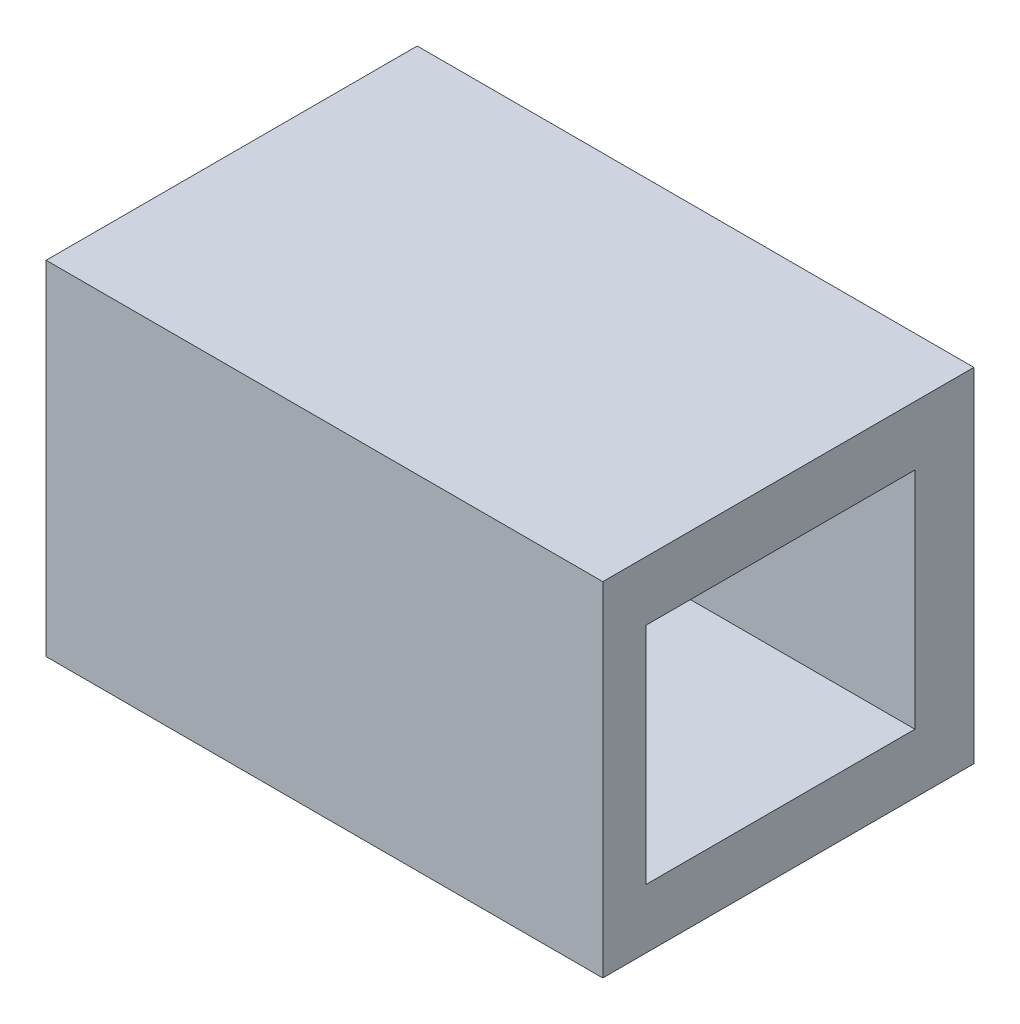
ISO-10303-21;
HEADER;
FILE_DESCRIPTION(('STEP AP214'),'2;1');
FILE_NAME('part.step','',(''),(''),'','','');
FILE_SCHEMA(('AUTOMOTIVE_DESIGN { 1 0 10303 214 1 1 1 1 }'));
ENDSEC;
DATA;
#1=APPLICATION_CONTEXT('core data for automotive mechanical design processes');
#2=APPLICATION_PROTOCOL_DEFINITION('international standard','automotive_design',2000,#1);
#3=PRODUCT_CONTEXT('',#1,'mechanical');
#4=PRODUCT('Part','Part','',(#3));
#5=PRODUCT_RELATED_PRODUCT_CATEGORY('part','',(#4));
#6=PRODUCT_DEFINITION_FORMATION('','',#4);
#7=PRODUCT_DEFINITION_CONTEXT('part definition',#1,'design');
#8=PRODUCT_DEFINITION('design','',#6,#7);
#9=PRODUCT_DEFINITION_SHAPE('','',#8);
#10=(LENGTH_UNIT() NAMED_UNIT(*) SI_UNIT(.MILLI.,.METRE.));
#11=(NAMED_UNIT(*) PLANE_ANGLE_UNIT() SI_UNIT($,.RADIAN.));
#12=(NAMED_UNIT(*) SI_UNIT($,.STERADIAN.) SOLID_ANGLE_UNIT());
#13=UNCERTAINTY_MEASURE_WITH_UNIT(LENGTH_MEASURE(1.E-05),#10,'distance_accuracy_value','');
#14=(GEOMETRIC_REPRESENTATION_CONTEXT(3) GLOBAL_UNCERTAINTY_ASSIGNED_CONTEXT((#13)) GLOBAL_UNIT_ASSIGNED_CONTEXT((#10,
#11,#12)) REPRESENTATION_CONTEXT('',''));
#15=CARTESIAN_POINT('',(0.,0.,0.));
#16=DIRECTION('',(0.,0.,1.));
#17=DIRECTION('',(1.,0.,0.));
#18=AXIS2_PLACEMENT_3D('',#15,#16,#17);
#19=CARTESIAN_POINT('',(0.,0.,20.));
#20=DIRECTION('',(1.,0.,0.));
#21=DIRECTION('',(0.,0.,-1.));
#22=AXIS2_PLACEMENT_3D('',#19,#20,#21);
#23=PLANE('',#22);
#24=DIRECTION('',(0.,-1.,0.));
#25=VECTOR('',#24,1.);
#26=CARTESIAN_POINT('',(0.,0.,17.6770086484339));
#27=LINE('',#26,#25);
#28=CARTESIAN_POINT('',(0.,15.3,17.6770086484339));
#29=VERTEX_POINT('',#28);
#30=CARTESIAN_POINT('',(0.,3.19999999999999,17.6770086484339));
#31=VERTEX_POINT('',#30);
#32=EDGE_CURVE('E128',#29,#31,#27,.T.);
#33=ORIENTED_EDGE('',*,*,#32,.T.);
#34=DIRECTION('',(0.,0.,-1.));
#35=VECTOR('',#34,1.);
#36=CARTESIAN_POINT('',(0.,3.19999999999999,20.));
#37=LINE('',#36,#35);
#38=CARTESIAN_POINT('',(0.,3.19999999999999,3.17700864843391));
#39=VERTEX_POINT('',#38);
#40=EDGE_CURVE('E131',#31,#39,#37,.T.);
#41=ORIENTED_EDGE('',*,*,#40,.T.);
#42=DIRECTION('',(0.,1.,0.));
#43=VECTOR('',#42,1.);
#44=CARTESIAN_POINT('',(0.,0.,3.17700864843391));
#45=LINE('',#44,#43);
#46=CARTESIAN_POINT('',(0.,15.3,3.17700864843391));
#47=VERTEX_POINT('',#46);
#48=EDGE_CURVE('E123',#39,#47,#45,.T.);
#49=ORIENTED_EDGE('',*,*,#48,.T.);
#50=DIRECTION('',(0.,0.,1.));
#51=VECTOR('',#50,1.);
#52=CARTESIAN_POINT('',(0.,15.3,20.));
#53=LINE('',#52,#51);
#54=EDGE_CURVE('E103',#47,#29,#53,.T.);
#55=ORIENTED_EDGE('',*,*,#54,.T.);
#56=EDGE_LOOP('',(#33,#41,#49,#55));
#57=FACE_BOUND('',#56,.T.);
#58=DIRECTION('',(0.,-1.,0.));
#59=VECTOR('',#58,1.);
#60=CARTESIAN_POINT('',(0.,0.,0.));
#61=LINE('',#60,#59);
#62=CARTESIAN_POINT('',(0.,18.5,0.));
#63=VERTEX_POINT('',#62);
#64=CARTESIAN_POINT('',(0.,0.,0.));
#65=VERTEX_POINT('',#64);
#66=EDGE_CURVE('E134',#63,#65,#61,.T.);
#67=ORIENTED_EDGE('',*,*,#66,.T.);
#68=DIRECTION('',(0.,0.,-1.));
#69=VECTOR('',#68,1.);
#70=CARTESIAN_POINT('',(0.,0.,20.));
#71=LINE('',#70,#69);
#72=CARTESIAN_POINT('',(0.,0.,20.));
#73=VERTEX_POINT('',#72);
#74=EDGE_CURVE('E11',#73,#65,#71,.T.);
#75=ORIENTED_EDGE('',*,*,#74,.F.);
#76=DIRECTION('',(0.,-1.,0.));
#77=VECTOR('',#76,1.);
#78=CARTESIAN_POINT('',(0.,0.,20.));
#79=LINE('',#78,#77);
#80=CARTESIAN_POINT('',(0.,18.5,20.));
#81=VERTEX_POINT('',#80);
#82=EDGE_CURVE('E135',#81,#73,#79,.T.);
#83=ORIENTED_EDGE('',*,*,#82,.F.);
#84=DIRECTION('',(0.,0.,-1.));
#85=VECTOR('',#84,1.);
#86=CARTESIAN_POINT('',(0.,18.5,20.));
#87=LINE('',#86,#85);
#88=EDGE_CURVE('E145',#81,#63,#87,.T.);
#89=ORIENTED_EDGE('',*,*,#88,.T.);
#90=EDGE_LOOP('',(#67,#75,#83,#89));
#91=FACE_BOUND('',#90,.T.);
#92=ADVANCED_FACE('F33',(#57,#91),#23,.F.);
#93=CARTESIAN_POINT('',(0.,0.,20.));
#94=DIRECTION('',(0.,1.,0.));
#95=DIRECTION('',(0.,0.,1.));
#96=AXIS2_PLACEMENT_3D('',#93,#94,#95);
#97=PLANE('',#96);
#98=DIRECTION('',(1.,0.,0.));
#99=VECTOR('',#98,1.);
#100=CARTESIAN_POINT('',(0.,0.,0.));
#101=LINE('',#100,#99);
#102=CARTESIAN_POINT('',(30.,0.,0.));
#103=VERTEX_POINT('',#102);
#104=EDGE_CURVE('E148',#65,#103,#101,.T.);
#105=ORIENTED_EDGE('',*,*,#104,.T.);
#106=DIRECTION('',(0.,0.,-1.));
#107=VECTOR('',#106,1.);
#108=CARTESIAN_POINT('',(30.,0.,20.));
#109=LINE('',#108,#107);
#110=CARTESIAN_POINT('',(30.,0.,20.));
#111=VERTEX_POINT('',#110);
#112=EDGE_CURVE('E40',#111,#103,#109,.T.);
#113=ORIENTED_EDGE('',*,*,#112,.F.);
#114=DIRECTION('',(1.,0.,0.));
#115=VECTOR('',#114,1.);
#116=CARTESIAN_POINT('',(0.,0.,20.));
#117=LINE('',#116,#115);
#118=EDGE_CURVE('E138',#73,#111,#117,.T.);
#119=ORIENTED_EDGE('',*,*,#118,.F.);
#120=ORIENTED_EDGE('',*,*,#74,.T.);
#121=EDGE_LOOP('',(#105,#113,#119,#120));
#122=FACE_BOUND('',#121,.T.);
#123=ADVANCED_FACE('F176',(#122),#97,.F.);
#124=CARTESIAN_POINT('',(30.,0.,20.));
#125=DIRECTION('',(-1.,0.,0.));
#126=DIRECTION('',(0.,-1.,0.));
#127=AXIS2_PLACEMENT_3D('',#124,#125,#126);
#128=PLANE('',#127);
#129=DIRECTION('',(0.,1.,0.));
#130=VECTOR('',#129,1.);
#131=CARTESIAN_POINT('',(30.,15.3,3.17700864843391));
#132=LINE('',#131,#130);
#133=CARTESIAN_POINT('',(30.,3.19999999999999,3.17700864843391));
#134=VERTEX_POINT('',#133);
#135=CARTESIAN_POINT('',(30.,15.3,3.17700864843391));
#136=VERTEX_POINT('',#135);
#137=EDGE_CURVE('E109',#134,#136,#132,.T.);
#138=ORIENTED_EDGE('',*,*,#137,.F.);
#139=DIRECTION('',(0.,0.,-1.));
#140=VECTOR('',#139,1.);
#141=CARTESIAN_POINT('',(30.,3.2,3.17700864843391));
#142=LINE('',#141,#140);
#143=CARTESIAN_POINT('',(30.,3.2,17.6770086484339));
#144=VERTEX_POINT('',#143);
#145=EDGE_CURVE('E55',#144,#134,#142,.T.);
#146=ORIENTED_EDGE('',*,*,#145,.F.);
#147=DIRECTION('',(0.,-1.,0.));
#148=VECTOR('',#147,1.);
#149=CARTESIAN_POINT('',(30.,3.2,17.6770086484339));
#150=LINE('',#149,#148);
#151=CARTESIAN_POINT('',(30.,15.3,17.6770086484339));
#152=VERTEX_POINT('',#151);
#153=EDGE_CURVE('E116',#152,#144,#150,.T.);
#154=ORIENTED_EDGE('',*,*,#153,.F.);
#155=DIRECTION('',(0.,0.,1.));
#156=VECTOR('',#155,1.);
#157=CARTESIAN_POINT('',(30.,15.3,17.6770086484339));
#158=LINE('',#157,#156);
#159=EDGE_CURVE('E100',#136,#152,#158,.T.);
#160=ORIENTED_EDGE('',*,*,#159,.F.);
#161=EDGE_LOOP('',(#138,#146,#154,#160));
#162=FACE_BOUND('',#161,.T.);
#163=DIRECTION('',(0.,1.,0.));
#164=VECTOR('',#163,1.);
#165=CARTESIAN_POINT('',(30.,0.,0.));
#166=LINE('',#165,#164);
#167=CARTESIAN_POINT('',(30.,18.5,0.));
#168=VERTEX_POINT('',#167);
#169=EDGE_CURVE('E150',#103,#168,#166,.T.);
#170=ORIENTED_EDGE('',*,*,#169,.T.);
#171=DIRECTION('',(0.,0.,-1.));
#172=VECTOR('',#171,1.);
#173=CARTESIAN_POINT('',(30.,18.5,20.));
#174=LINE('',#173,#172);
#175=CARTESIAN_POINT('',(30.,18.5,20.));
#176=VERTEX_POINT('',#175);
#177=EDGE_CURVE('E155',#176,#168,#174,.T.);
#178=ORIENTED_EDGE('',*,*,#177,.F.);
#179=DIRECTION('',(0.,1.,0.));
#180=VECTOR('',#179,1.);
#181=CARTESIAN_POINT('',(30.,0.,20.));
#182=LINE('',#181,#180);
#183=EDGE_CURVE('E141',#111,#176,#182,.T.);
#184=ORIENTED_EDGE('',*,*,#183,.F.);
#185=ORIENTED_EDGE('',*,*,#112,.T.);
#186=EDGE_LOOP('',(#170,#178,#184,#185));
#187=FACE_BOUND('',#186,.T.);
#188=ADVANCED_FACE('F113',(#162,#187),#128,.F.);
#189=CARTESIAN_POINT('',(0.,18.5,20.));
#190=DIRECTION('',(0.,-1.,0.));
#191=DIRECTION('',(0.,0.,-1.));
#192=AXIS2_PLACEMENT_3D('',#189,#190,#191);
#193=PLANE('',#192);
#194=DIRECTION('',(-1.,0.,0.));
#195=VECTOR('',#194,1.);
#196=CARTESIAN_POINT('',(0.,18.5,0.));
#197=LINE('',#196,#195);
#198=EDGE_CURVE('E139',#168,#63,#197,.T.);
#199=ORIENTED_EDGE('',*,*,#198,.T.);
#200=ORIENTED_EDGE('',*,*,#88,.F.);
#201=DIRECTION('',(-1.,0.,0.));
#202=VECTOR('',#201,1.);
#203=CARTESIAN_POINT('',(0.,18.5,20.));
#204=LINE('',#203,#202);
#205=EDGE_CURVE('E143',#176,#81,#204,.T.);
#206=ORIENTED_EDGE('',*,*,#205,.F.);
#207=ORIENTED_EDGE('',*,*,#177,.T.);
#208=EDGE_LOOP('',(#199,#200,#206,#207));
#209=FACE_BOUND('',#208,.T.);
#210=ADVANCED_FACE('F169',(#209),#193,.F.);
#211=CARTESIAN_POINT('',(0.,0.,20.));
#212=DIRECTION('',(0.,0.,-1.));
#213=DIRECTION('',(-1.,0.,0.));
#214=AXIS2_PLACEMENT_3D('',#211,#212,#213);
#215=PLANE('',#214);
#216=ORIENTED_EDGE('',*,*,#82,.T.);
#217=ORIENTED_EDGE('',*,*,#118,.T.);
#218=ORIENTED_EDGE('',*,*,#183,.T.);
#219=ORIENTED_EDGE('',*,*,#205,.T.);
#220=EDGE_LOOP('',(#216,#217,#218,#219));
#221=FACE_BOUND('',#220,.T.);
#222=ADVANCED_FACE('F175',(#221),#215,.F.);
#223=CARTESIAN_POINT('',(0.,0.,0.));
#224=DIRECTION('',(0.,0.,-1.));
#225=DIRECTION('',(-1.,0.,0.));
#226=AXIS2_PLACEMENT_3D('',#223,#224,#225);
#227=PLANE('',#226);
#228=ORIENTED_EDGE('',*,*,#66,.F.);
#229=ORIENTED_EDGE('',*,*,#198,.F.);
#230=ORIENTED_EDGE('',*,*,#169,.F.);
#231=ORIENTED_EDGE('',*,*,#104,.F.);
#232=EDGE_LOOP('',(#228,#229,#230,#231));
#233=FACE_BOUND('',#232,.T.);
#234=ADVANCED_FACE('F166',(#233),#227,.T.);
#235=CARTESIAN_POINT('',(-9.00000000000001,3.19999999999999,3.17700864843391));
#236=DIRECTION('',(0.,-1.,0.));
#237=DIRECTION('',(1.,0.,0.));
#238=AXIS2_PLACEMENT_3D('',#235,#236,#237);
#239=PLANE('',#238);
#240=DIRECTION('',(1.,0.,0.));
#241=VECTOR('',#240,1.);
#242=CARTESIAN_POINT('',(-9.00000000000001,3.19999999999999,17.6770086484339));
#243=LINE('',#242,#241);
#244=EDGE_CURVE('E121',#31,#144,#243,.T.);
#245=ORIENTED_EDGE('',*,*,#244,.T.);
#246=ORIENTED_EDGE('',*,*,#145,.T.);
#247=DIRECTION('',(1.,0.,0.));
#248=VECTOR('',#247,1.);
#249=CARTESIAN_POINT('',(-9.00000000000001,3.19999999999999,3.17700864843391));
#250=LINE('',#249,#248);
#251=EDGE_CURVE('E106',#39,#134,#250,.T.);
#252=ORIENTED_EDGE('',*,*,#251,.F.);
#253=ORIENTED_EDGE('',*,*,#40,.F.);
#254=EDGE_LOOP('',(#245,#246,#252,#253));
#255=FACE_BOUND('',#254,.T.);
#256=ADVANCED_FACE('F189',(#255),#239,.F.);
#257=CARTESIAN_POINT('',(-9.00000000000001,3.19999999999999,17.6770086484339));
#258=DIRECTION('',(0.,0.,1.));
#259=DIRECTION('',(1.,0.,0.));
#260=AXIS2_PLACEMENT_3D('',#257,#258,#259);
#261=PLANE('',#260);
#262=DIRECTION('',(1.,0.,0.));
#263=VECTOR('',#262,1.);
#264=CARTESIAN_POINT('',(-9.00000000000002,15.3,17.6770086484339));
#265=LINE('',#264,#263);
#266=EDGE_CURVE('E105',#29,#152,#265,.T.);
#267=ORIENTED_EDGE('',*,*,#266,.T.);
#268=ORIENTED_EDGE('',*,*,#153,.T.);
#269=ORIENTED_EDGE('',*,*,#244,.F.);
#270=ORIENTED_EDGE('',*,*,#32,.F.);
#271=EDGE_LOOP('',(#267,#268,#269,#270));
#272=FACE_BOUND('',#271,.T.);
#273=ADVANCED_FACE('F194',(#272),#261,.F.);
#274=CARTESIAN_POINT('',(-9.00000000000002,15.3,17.6770086484339));
#275=DIRECTION('',(0.,1.,0.));
#276=DIRECTION('',(-1.,0.,0.));
#277=AXIS2_PLACEMENT_3D('',#274,#275,#276);
#278=PLANE('',#277);
#279=DIRECTION('',(1.,0.,0.));
#280=VECTOR('',#279,1.);
#281=CARTESIAN_POINT('',(-9.00000000000002,15.3,3.17700864843391));
#282=LINE('',#281,#280);
#283=EDGE_CURVE('E47',#47,#136,#282,.T.);
#284=ORIENTED_EDGE('',*,*,#283,.T.);
#285=ORIENTED_EDGE('',*,*,#159,.T.);
#286=ORIENTED_EDGE('',*,*,#266,.F.);
#287=ORIENTED_EDGE('',*,*,#54,.F.);
#288=EDGE_LOOP('',(#284,#285,#286,#287));
#289=FACE_BOUND('',#288,.T.);
#290=ADVANCED_FACE('F97',(#289),#278,.F.);
#291=CARTESIAN_POINT('',(-9.00000000000002,15.3,3.17700864843391));
#292=DIRECTION('',(0.,0.,-1.));
#293=DIRECTION('',(-1.,0.,0.));
#294=AXIS2_PLACEMENT_3D('',#291,#292,#293);
#295=PLANE('',#294);
#296=ORIENTED_EDGE('',*,*,#251,.T.);
#297=ORIENTED_EDGE('',*,*,#137,.T.);
#298=ORIENTED_EDGE('',*,*,#283,.F.);
#299=ORIENTED_EDGE('',*,*,#48,.F.);
#300=EDGE_LOOP('',(#296,#297,#298,#299));
#301=FACE_BOUND('',#300,.T.);
#302=ADVANCED_FACE('F110',(#301),#295,.F.);
#303=CLOSED_SHELL('',(#92,#123,#188,#210,#222,#234,#256,#273,#290,#302));
#304=MANIFOLD_SOLID_BREP('B2',#303);
#305=ADVANCED_BREP_SHAPE_REPRESENTATION('',(#18,#304),#14);
#306=SHAPE_DEFINITION_REPRESENTATION(#9,#305);
ENDSEC;
END-ISO-10303-21;
